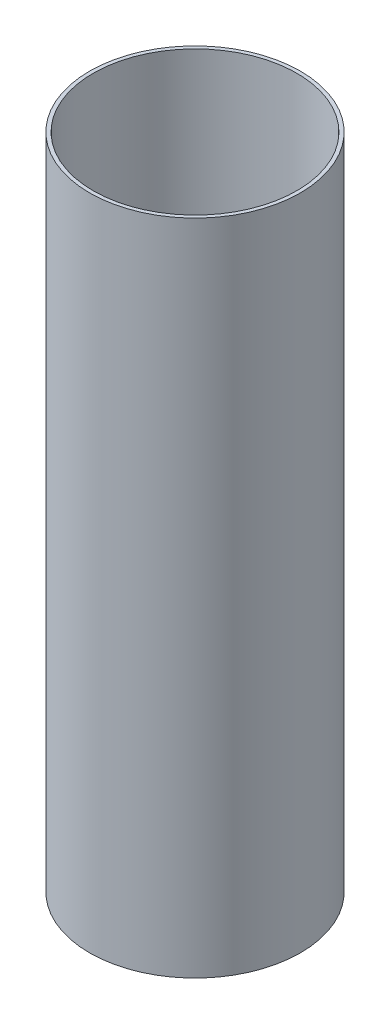
ISO-10303-21;
HEADER;
FILE_DESCRIPTION(('STEP AP214'),'2;1');
FILE_NAME('part.step','',(''),(''),'','','');
FILE_SCHEMA(('AUTOMOTIVE_DESIGN { 1 0 10303 214 1 1 1 1 }'));
ENDSEC;
DATA;
#1=APPLICATION_CONTEXT('core data for automotive mechanical design processes');
#2=APPLICATION_PROTOCOL_DEFINITION('international standard','automotive_design',2000,#1);
#3=PRODUCT_CONTEXT('',#1,'mechanical');
#4=PRODUCT('Part','Part','',(#3));
#5=PRODUCT_RELATED_PRODUCT_CATEGORY('part','',(#4));
#6=PRODUCT_DEFINITION_FORMATION('','',#4);
#7=PRODUCT_DEFINITION_CONTEXT('part definition',#1,'design');
#8=PRODUCT_DEFINITION('design','',#6,#7);
#9=PRODUCT_DEFINITION_SHAPE('','',#8);
#10=(LENGTH_UNIT() NAMED_UNIT(*) SI_UNIT(.MILLI.,.METRE.));
#11=(NAMED_UNIT(*) PLANE_ANGLE_UNIT() SI_UNIT($,.RADIAN.));
#12=(NAMED_UNIT(*) SI_UNIT($,.STERADIAN.) SOLID_ANGLE_UNIT());
#13=UNCERTAINTY_MEASURE_WITH_UNIT(LENGTH_MEASURE(1.E-05),#10,'distance_accuracy_value','');
#14=(GEOMETRIC_REPRESENTATION_CONTEXT(3) GLOBAL_UNCERTAINTY_ASSIGNED_CONTEXT((#13)) GLOBAL_UNIT_ASSIGNED_CONTEXT((#10,
#11,#12)) REPRESENTATION_CONTEXT('',''));
#15=CARTESIAN_POINT('',(0.,0.,0.));
#16=DIRECTION('',(0.,0.,1.));
#17=DIRECTION('',(1.,0.,0.));
#18=AXIS2_PLACEMENT_3D('',#15,#16,#17);
#19=CARTESIAN_POINT('',(0.,574.675,0.));
#20=DIRECTION('',(0.,-1.,0.));
#21=DIRECTION('',(0.,0.,-1.));
#22=AXIS2_PLACEMENT_3D('',#19,#20,#21);
#23=CYLINDRICAL_SURFACE('',#22,88.9000000000006);
#24=CARTESIAN_POINT('',(0.,574.675,0.));
#25=DIRECTION('',(0.,1.,0.));
#26=DIRECTION('',(0.,0.,1.));
#27=AXIS2_PLACEMENT_3D('',#24,#25,#26);
#28=CIRCLE('',#27,88.9000000000006);
#29=CARTESIAN_POINT('',(0.,574.675,88.9000000000006));
#30=VERTEX_POINT('',#29);
#31=EDGE_CURVE('E40',#30,#30,#28,.T.);
#32=ORIENTED_EDGE('',*,*,#31,.T.);
#33=EDGE_LOOP('',(#32));
#34=FACE_BOUND('',#33,.T.);
#35=CARTESIAN_POINT('',(0.,0.,0.));
#36=DIRECTION('',(0.,1.,0.));
#37=DIRECTION('',(0.,0.,1.));
#38=AXIS2_PLACEMENT_3D('',#35,#36,#37);
#39=CIRCLE('',#38,88.9000000000006);
#40=CARTESIAN_POINT('',(0.,0.,88.9000000000006));
#41=VERTEX_POINT('',#40);
#42=EDGE_CURVE('E46',#41,#41,#39,.T.);
#43=ORIENTED_EDGE('',*,*,#42,.F.);
#44=EDGE_LOOP('',(#43));
#45=FACE_BOUND('',#44,.T.);
#46=ADVANCED_FACE('F33',(#34,#45),#23,.F.);
#47=CARTESIAN_POINT('',(0.,574.675,0.));
#48=DIRECTION('',(0.,-1.,0.));
#49=DIRECTION('',(0.,0.,-1.));
#50=AXIS2_PLACEMENT_3D('',#47,#48,#49);
#51=CYLINDRICAL_SURFACE('',#50,92.075);
#52=CARTESIAN_POINT('',(0.,574.675,0.));
#53=DIRECTION('',(0.,1.,0.));
#54=DIRECTION('',(0.,0.,1.));
#55=AXIS2_PLACEMENT_3D('',#52,#53,#54);
#56=CIRCLE('',#55,92.075);
#57=CARTESIAN_POINT('',(0.,574.675,92.075));
#58=VERTEX_POINT('',#57);
#59=EDGE_CURVE('E10',#58,#58,#56,.T.);
#60=ORIENTED_EDGE('',*,*,#59,.F.);
#61=EDGE_LOOP('',(#60));
#62=FACE_BOUND('',#61,.T.);
#63=CARTESIAN_POINT('',(0.,0.,0.));
#64=DIRECTION('',(0.,1.,0.));
#65=DIRECTION('',(0.,0.,1.));
#66=AXIS2_PLACEMENT_3D('',#63,#64,#65);
#67=CIRCLE('',#66,92.075);
#68=CARTESIAN_POINT('',(0.,0.,92.075));
#69=VERTEX_POINT('',#68);
#70=EDGE_CURVE('E36',#69,#69,#67,.T.);
#71=ORIENTED_EDGE('',*,*,#70,.T.);
#72=EDGE_LOOP('',(#71));
#73=FACE_BOUND('',#72,.T.);
#74=ADVANCED_FACE('F53',(#62,#73),#51,.T.);
#75=CARTESIAN_POINT('',(0.,574.675,0.));
#76=DIRECTION('',(0.,1.,0.));
#77=DIRECTION('',(0.,0.,1.));
#78=AXIS2_PLACEMENT_3D('',#75,#76,#77);
#79=PLANE('',#78);
#80=ORIENTED_EDGE('',*,*,#31,.F.);
#81=EDGE_LOOP('',(#80));
#82=FACE_BOUND('',#81,.T.);
#83=ORIENTED_EDGE('',*,*,#59,.T.);
#84=EDGE_LOOP('',(#83));
#85=FACE_BOUND('',#84,.T.);
#86=ADVANCED_FACE('F57',(#82,#85),#79,.T.);
#87=CARTESIAN_POINT('',(0.,0.,0.));
#88=DIRECTION('',(0.,1.,0.));
#89=DIRECTION('',(0.,0.,1.));
#90=AXIS2_PLACEMENT_3D('',#87,#88,#89);
#91=PLANE('',#90);
#92=ORIENTED_EDGE('',*,*,#42,.T.);
#93=EDGE_LOOP('',(#92));
#94=FACE_BOUND('',#93,.T.);
#95=ORIENTED_EDGE('',*,*,#70,.F.);
#96=EDGE_LOOP('',(#95));
#97=FACE_BOUND('',#96,.T.);
#98=ADVANCED_FACE('F55',(#94,#97),#91,.F.);
#99=CLOSED_SHELL('',(#46,#74,#86,#98));
#100=MANIFOLD_SOLID_BREP('B2',#99);
#101=ADVANCED_BREP_SHAPE_REPRESENTATION('',(#18,#100),#14);
#102=SHAPE_DEFINITION_REPRESENTATION(#9,#101);
ENDSEC;
END-ISO-10303-21;
